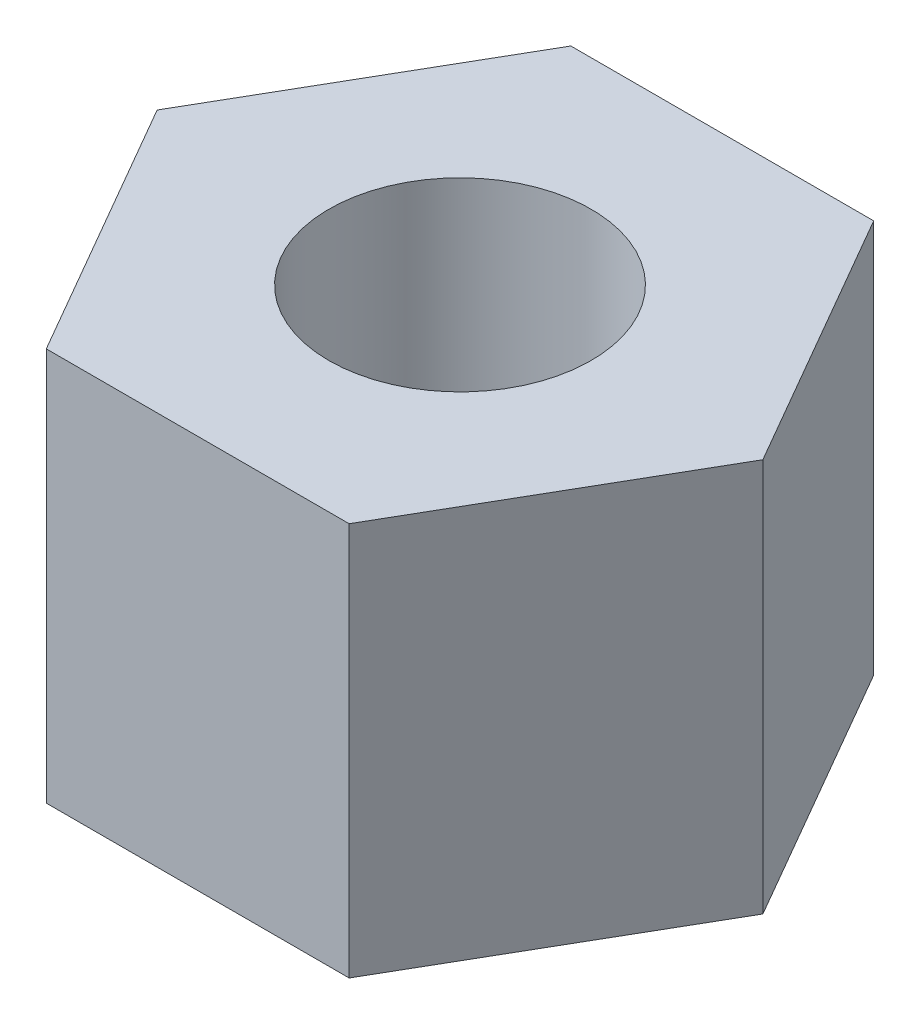
ISO-10303-21;
HEADER;
FILE_DESCRIPTION(('STEP AP214'),'2;1');
FILE_NAME('part.step','',(''),(''),'','','');
FILE_SCHEMA(('AUTOMOTIVE_DESIGN { 1 0 10303 214 1 1 1 1 }'));
ENDSEC;
DATA;
#1=APPLICATION_CONTEXT('core data for automotive mechanical design processes');
#2=APPLICATION_PROTOCOL_DEFINITION('international standard','automotive_design',2000,#1);
#3=PRODUCT_CONTEXT('',#1,'mechanical');
#4=PRODUCT('Part','Part','',(#3));
#5=PRODUCT_RELATED_PRODUCT_CATEGORY('part','',(#4));
#6=PRODUCT_DEFINITION_FORMATION('','',#4);
#7=PRODUCT_DEFINITION_CONTEXT('part definition',#1,'design');
#8=PRODUCT_DEFINITION('design','',#6,#7);
#9=PRODUCT_DEFINITION_SHAPE('','',#8);
#10=(LENGTH_UNIT() NAMED_UNIT(*) SI_UNIT(.MILLI.,.METRE.));
#11=(NAMED_UNIT(*) PLANE_ANGLE_UNIT() SI_UNIT($,.RADIAN.));
#12=(NAMED_UNIT(*) SI_UNIT($,.STERADIAN.) SOLID_ANGLE_UNIT());
#13=UNCERTAINTY_MEASURE_WITH_UNIT(LENGTH_MEASURE(1.E-05),#10,'distance_accuracy_value','');
#14=(GEOMETRIC_REPRESENTATION_CONTEXT(3) GLOBAL_UNCERTAINTY_ASSIGNED_CONTEXT((#13)) GLOBAL_UNIT_ASSIGNED_CONTEXT((#10,
#11,#12)) REPRESENTATION_CONTEXT('',''));
#15=CARTESIAN_POINT('',(0.,0.,0.));
#16=DIRECTION('',(0.,0.,1.));
#17=DIRECTION('',(1.,0.,0.));
#18=AXIS2_PLACEMENT_3D('',#15,#16,#17);
#19=CARTESIAN_POINT('',(0.,3.,0.));
#20=DIRECTION('',(0.,1.,0.));
#21=DIRECTION('',(0.,0.,1.));
#22=AXIS2_PLACEMENT_3D('',#19,#20,#21);
#23=PLANE('',#22);
#24=DIRECTION('',(0.499999999999995,0.,-0.866025403784442));
#25=VECTOR('',#24,1.);
#26=CARTESIAN_POINT('',(1.15470053837928,3.,1.99999999999999));
#27=LINE('',#26,#25);
#28=CARTESIAN_POINT('',(1.15470053837928,3.,1.99999999999999));
#29=VERTEX_POINT('',#28);
#30=CARTESIAN_POINT('',(2.3094010767585,3.,0.));
#31=VERTEX_POINT('',#30);
#32=EDGE_CURVE('E146',#29,#31,#27,.T.);
#33=ORIENTED_EDGE('',*,*,#32,.T.);
#34=DIRECTION('',(-0.500000000000001,0.,-0.866025403784438));
#35=VECTOR('',#34,1.);
#36=CARTESIAN_POINT('',(2.3094010767585,3.,0.));
#37=LINE('',#36,#35);
#38=CARTESIAN_POINT('',(1.15470053837925,3.,-2.));
#39=VERTEX_POINT('',#38);
#40=EDGE_CURVE('E94',#31,#39,#37,.T.);
#41=ORIENTED_EDGE('',*,*,#40,.T.);
#42=DIRECTION('',(-1.,0.,0.));
#43=VECTOR('',#42,1.);
#44=CARTESIAN_POINT('',(1.15470053837925,3.,-2.));
#45=LINE('',#44,#43);
#46=CARTESIAN_POINT('',(-1.15470053837926,3.,-2.));
#47=VERTEX_POINT('',#46);
#48=EDGE_CURVE('E107',#39,#47,#45,.T.);
#49=ORIENTED_EDGE('',*,*,#48,.T.);
#50=DIRECTION('',(-0.499999999999995,0.,0.866025403784442));
#51=VECTOR('',#50,1.);
#52=CARTESIAN_POINT('',(-1.15470053837926,3.,-2.));
#53=LINE('',#52,#51);
#54=CARTESIAN_POINT('',(-2.3094010767585,3.,0.));
#55=VERTEX_POINT('',#54);
#56=EDGE_CURVE('E101',#47,#55,#53,.T.);
#57=ORIENTED_EDGE('',*,*,#56,.T.);
#58=DIRECTION('',(0.500000000000007,0.,0.866025403784435));
#59=VECTOR('',#58,1.);
#60=CARTESIAN_POINT('',(-2.3094010767585,3.,0.));
#61=LINE('',#60,#59);
#62=CARTESIAN_POINT('',(-1.15470053837923,3.,2.00000000000001));
#63=VERTEX_POINT('',#62);
#64=EDGE_CURVE('E105',#55,#63,#61,.T.);
#65=ORIENTED_EDGE('',*,*,#64,.T.);
#66=DIRECTION('',(1.,0.,0.));
#67=VECTOR('',#66,1.);
#68=CARTESIAN_POINT('',(-1.15470053837923,3.,2.00000000000001));
#69=LINE('',#68,#67);
#70=EDGE_CURVE('E57',#63,#29,#69,.T.);
#71=ORIENTED_EDGE('',*,*,#70,.T.);
#72=EDGE_LOOP('',(#33,#41,#49,#57,#65,#71));
#73=FACE_BOUND('',#72,.T.);
#74=CARTESIAN_POINT('',(0.,3.,0.));
#75=DIRECTION('',(0.,1.,0.));
#76=DIRECTION('',(0.,0.,1.));
#77=AXIS2_PLACEMENT_3D('',#74,#75,#76);
#78=CIRCLE('',#77,1.);
#79=CARTESIAN_POINT('',(0.,3.,1.));
#80=VERTEX_POINT('',#79);
#81=EDGE_CURVE('E134',#80,#80,#78,.T.);
#82=ORIENTED_EDGE('',*,*,#81,.F.);
#83=EDGE_LOOP('',(#82));
#84=FACE_BOUND('',#83,.T.);
#85=ADVANCED_FACE('F39',(#73,#84),#23,.T.);
#86=CARTESIAN_POINT('',(0.,0.,0.));
#87=DIRECTION('',(0.,1.,0.));
#88=DIRECTION('',(0.,0.,1.));
#89=AXIS2_PLACEMENT_3D('',#86,#87,#88);
#90=PLANE('',#89);
#91=DIRECTION('',(0.499999999999995,0.,-0.866025403784442));
#92=VECTOR('',#91,1.);
#93=CARTESIAN_POINT('',(1.15470053837928,0.,1.99999999999999));
#94=LINE('',#93,#92);
#95=CARTESIAN_POINT('',(1.15470053837928,0.,1.99999999999999));
#96=VERTEX_POINT('',#95);
#97=CARTESIAN_POINT('',(2.3094010767585,0.,0.));
#98=VERTEX_POINT('',#97);
#99=EDGE_CURVE('E129',#96,#98,#94,.T.);
#100=ORIENTED_EDGE('',*,*,#99,.F.);
#101=DIRECTION('',(1.,0.,0.));
#102=VECTOR('',#101,1.);
#103=CARTESIAN_POINT('',(-1.15470053837923,0.,2.00000000000001));
#104=LINE('',#103,#102);
#105=CARTESIAN_POINT('',(-1.15470053837923,0.,2.00000000000001));
#106=VERTEX_POINT('',#105);
#107=EDGE_CURVE('E86',#106,#96,#104,.T.);
#108=ORIENTED_EDGE('',*,*,#107,.F.);
#109=DIRECTION('',(0.500000000000007,0.,0.866025403784435));
#110=VECTOR('',#109,1.);
#111=CARTESIAN_POINT('',(-2.3094010767585,0.,0.));
#112=LINE('',#111,#110);
#113=CARTESIAN_POINT('',(-2.3094010767585,0.,0.));
#114=VERTEX_POINT('',#113);
#115=EDGE_CURVE('E80',#114,#106,#112,.T.);
#116=ORIENTED_EDGE('',*,*,#115,.F.);
#117=DIRECTION('',(-0.499999999999995,0.,0.866025403784442));
#118=VECTOR('',#117,1.);
#119=CARTESIAN_POINT('',(-1.15470053837926,0.,-2.));
#120=LINE('',#119,#118);
#121=CARTESIAN_POINT('',(-1.15470053837926,0.,-2.));
#122=VERTEX_POINT('',#121);
#123=EDGE_CURVE('E116',#122,#114,#120,.T.);
#124=ORIENTED_EDGE('',*,*,#123,.F.);
#125=DIRECTION('',(-1.,0.,0.));
#126=VECTOR('',#125,1.);
#127=CARTESIAN_POINT('',(1.15470053837925,0.,-2.));
#128=LINE('',#127,#126);
#129=CARTESIAN_POINT('',(1.15470053837925,0.,-2.));
#130=VERTEX_POINT('',#129);
#131=EDGE_CURVE('E137',#130,#122,#128,.T.);
#132=ORIENTED_EDGE('',*,*,#131,.F.);
#133=DIRECTION('',(-0.500000000000001,0.,-0.866025403784438));
#134=VECTOR('',#133,1.);
#135=CARTESIAN_POINT('',(2.3094010767585,0.,0.));
#136=LINE('',#135,#134);
#137=EDGE_CURVE('E133',#98,#130,#136,.T.);
#138=ORIENTED_EDGE('',*,*,#137,.F.);
#139=EDGE_LOOP('',(#100,#108,#116,#124,#132,#138));
#140=FACE_BOUND('',#139,.T.);
#141=CARTESIAN_POINT('',(0.,0.,0.));
#142=DIRECTION('',(0.,1.,0.));
#143=DIRECTION('',(0.,0.,1.));
#144=AXIS2_PLACEMENT_3D('',#141,#142,#143);
#145=CIRCLE('',#144,1.);
#146=CARTESIAN_POINT('',(0.,0.,1.));
#147=VERTEX_POINT('',#146);
#148=EDGE_CURVE('E243',#147,#147,#145,.T.);
#149=ORIENTED_EDGE('',*,*,#148,.T.);
#150=EDGE_LOOP('',(#149));
#151=FACE_BOUND('',#150,.T.);
#152=ADVANCED_FACE('F159',(#140,#151),#90,.F.);
#153=CARTESIAN_POINT('',(1.15470053837928,3.,1.99999999999999));
#154=DIRECTION('',(-0.866025403784441,0.,-0.499999999999995));
#155=DIRECTION('',(-0.499999999999995,0.,0.866025403784442));
#156=AXIS2_PLACEMENT_3D('',#153,#154,#155);
#157=PLANE('',#156);
#158=ORIENTED_EDGE('',*,*,#99,.T.);
#159=DIRECTION('',(0.,-1.,0.));
#160=VECTOR('',#159,1.);
#161=CARTESIAN_POINT('',(2.3094010767585,3.,0.));
#162=LINE('',#161,#160);
#163=EDGE_CURVE('E11',#31,#98,#162,.T.);
#164=ORIENTED_EDGE('',*,*,#163,.F.);
#165=ORIENTED_EDGE('',*,*,#32,.F.);
#166=DIRECTION('',(0.,-1.,0.));
#167=VECTOR('',#166,1.);
#168=CARTESIAN_POINT('',(1.15470053837928,3.,1.99999999999999));
#169=LINE('',#168,#167);
#170=EDGE_CURVE('E125',#29,#96,#169,.T.);
#171=ORIENTED_EDGE('',*,*,#170,.T.);
#172=EDGE_LOOP('',(#158,#164,#165,#171));
#173=FACE_BOUND('',#172,.T.);
#174=ADVANCED_FACE('F41',(#173),#157,.F.);
#175=CARTESIAN_POINT('',(2.3094010767585,3.,0.));
#176=DIRECTION('',(-0.866025403784438,0.,0.500000000000001));
#177=DIRECTION('',(0.500000000000001,0.,0.866025403784438));
#178=AXIS2_PLACEMENT_3D('',#175,#176,#177);
#179=PLANE('',#178);
#180=ORIENTED_EDGE('',*,*,#137,.T.);
#181=DIRECTION('',(0.,-1.,0.));
#182=VECTOR('',#181,1.);
#183=CARTESIAN_POINT('',(1.15470053837925,3.,-2.));
#184=LINE('',#183,#182);
#185=EDGE_CURVE('E49',#39,#130,#184,.T.);
#186=ORIENTED_EDGE('',*,*,#185,.F.);
#187=ORIENTED_EDGE('',*,*,#40,.F.);
#188=ORIENTED_EDGE('',*,*,#163,.T.);
#189=EDGE_LOOP('',(#180,#186,#187,#188));
#190=FACE_BOUND('',#189,.T.);
#191=ADVANCED_FACE('F184',(#190),#179,.F.);
#192=CARTESIAN_POINT('',(1.15470053837925,3.,-2.));
#193=DIRECTION('',(0.,0.,1.));
#194=DIRECTION('',(1.,0.,0.));
#195=AXIS2_PLACEMENT_3D('',#192,#193,#194);
#196=PLANE('',#195);
#197=ORIENTED_EDGE('',*,*,#131,.T.);
#198=DIRECTION('',(0.,-1.,0.));
#199=VECTOR('',#198,1.);
#200=CARTESIAN_POINT('',(-1.15470053837926,3.,-2.));
#201=LINE('',#200,#199);
#202=EDGE_CURVE('E118',#47,#122,#201,.T.);
#203=ORIENTED_EDGE('',*,*,#202,.F.);
#204=ORIENTED_EDGE('',*,*,#48,.F.);
#205=ORIENTED_EDGE('',*,*,#185,.T.);
#206=EDGE_LOOP('',(#197,#203,#204,#205));
#207=FACE_BOUND('',#206,.T.);
#208=ADVANCED_FACE('F156',(#207),#196,.F.);
#209=CARTESIAN_POINT('',(-1.15470053837926,3.,-2.));
#210=DIRECTION('',(0.866025403784442,0.,0.499999999999995));
#211=DIRECTION('',(0.499999999999995,0.,-0.866025403784442));
#212=AXIS2_PLACEMENT_3D('',#209,#210,#211);
#213=PLANE('',#212);
#214=ORIENTED_EDGE('',*,*,#123,.T.);
#215=DIRECTION('',(0.,-1.,0.));
#216=VECTOR('',#215,1.);
#217=CARTESIAN_POINT('',(-2.3094010767585,3.,0.));
#218=LINE('',#217,#216);
#219=EDGE_CURVE('E113',#55,#114,#218,.T.);
#220=ORIENTED_EDGE('',*,*,#219,.F.);
#221=ORIENTED_EDGE('',*,*,#56,.F.);
#222=ORIENTED_EDGE('',*,*,#202,.T.);
#223=EDGE_LOOP('',(#214,#220,#221,#222));
#224=FACE_BOUND('',#223,.T.);
#225=ADVANCED_FACE('F114',(#224),#213,.F.);
#226=CARTESIAN_POINT('',(-2.3094010767585,3.,0.));
#227=DIRECTION('',(0.866025403784435,0.,-0.500000000000007));
#228=DIRECTION('',(-0.500000000000007,0.,-0.866025403784435));
#229=AXIS2_PLACEMENT_3D('',#226,#227,#228);
#230=PLANE('',#229);
#231=ORIENTED_EDGE('',*,*,#115,.T.);
#232=DIRECTION('',(0.,-1.,0.));
#233=VECTOR('',#232,1.);
#234=CARTESIAN_POINT('',(-1.15470053837923,3.,2.00000000000001));
#235=LINE('',#234,#233);
#236=EDGE_CURVE('E119',#63,#106,#235,.T.);
#237=ORIENTED_EDGE('',*,*,#236,.F.);
#238=ORIENTED_EDGE('',*,*,#64,.F.);
#239=ORIENTED_EDGE('',*,*,#219,.T.);
#240=EDGE_LOOP('',(#231,#237,#238,#239));
#241=FACE_BOUND('',#240,.T.);
#242=ADVANCED_FACE('F121',(#241),#230,.F.);
#243=CARTESIAN_POINT('',(-1.15470053837923,3.,2.00000000000001));
#244=DIRECTION('',(0.,0.,-1.));
#245=DIRECTION('',(-1.,0.,0.));
#246=AXIS2_PLACEMENT_3D('',#243,#244,#245);
#247=PLANE('',#246);
#248=ORIENTED_EDGE('',*,*,#107,.T.);
#249=ORIENTED_EDGE('',*,*,#170,.F.);
#250=ORIENTED_EDGE('',*,*,#70,.F.);
#251=ORIENTED_EDGE('',*,*,#236,.T.);
#252=EDGE_LOOP('',(#248,#249,#250,#251));
#253=FACE_BOUND('',#252,.T.);
#254=ADVANCED_FACE('F164',(#253),#247,.F.);
#255=CARTESIAN_POINT('',(0.,3.,0.));
#256=DIRECTION('',(0.,-1.,0.));
#257=DIRECTION('',(0.,0.,-1.));
#258=AXIS2_PLACEMENT_3D('',#255,#256,#257);
#259=CYLINDRICAL_SURFACE('',#258,1.);
#260=ORIENTED_EDGE('',*,*,#81,.T.);
#261=EDGE_LOOP('',(#260));
#262=FACE_BOUND('',#261,.T.);
#263=ORIENTED_EDGE('',*,*,#148,.F.);
#264=EDGE_LOOP('',(#263));
#265=FACE_BOUND('',#264,.T.);
#266=ADVANCED_FACE('F166',(#262,#265),#259,.F.);
#267=CLOSED_SHELL('',(#85,#152,#174,#191,#208,#225,#242,#254,#266));
#268=MANIFOLD_SOLID_BREP('B2',#267);
#269=ADVANCED_BREP_SHAPE_REPRESENTATION('',(#18,#268),#14);
#270=SHAPE_DEFINITION_REPRESENTATION(#9,#269);
ENDSEC;
END-ISO-10303-21;
